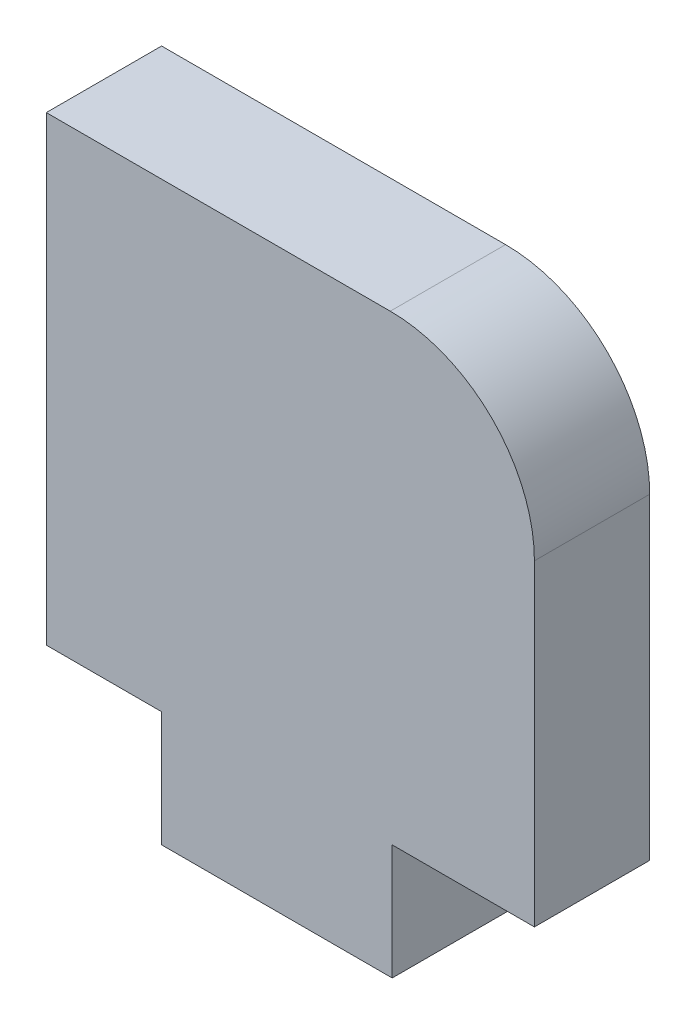
ISO-10303-21;
HEADER;
FILE_DESCRIPTION(('STEP AP214'),'2;1');
FILE_NAME('part.step','',(''),(''),'','','');
FILE_SCHEMA(('AUTOMOTIVE_DESIGN { 1 0 10303 214 1 1 1 1 }'));
ENDSEC;
DATA;
#1=APPLICATION_CONTEXT('core data for automotive mechanical design processes');
#2=APPLICATION_PROTOCOL_DEFINITION('international standard','automotive_design',2000,#1);
#3=PRODUCT_CONTEXT('',#1,'mechanical');
#4=PRODUCT('Part','Part','',(#3));
#5=PRODUCT_RELATED_PRODUCT_CATEGORY('part','',(#4));
#6=PRODUCT_DEFINITION_FORMATION('','',#4);
#7=PRODUCT_DEFINITION_CONTEXT('part definition',#1,'design');
#8=PRODUCT_DEFINITION('design','',#6,#7);
#9=PRODUCT_DEFINITION_SHAPE('','',#8);
#10=(LENGTH_UNIT() NAMED_UNIT(*) SI_UNIT(.MILLI.,.METRE.));
#11=(NAMED_UNIT(*) PLANE_ANGLE_UNIT() SI_UNIT($,.RADIAN.));
#12=(NAMED_UNIT(*) SI_UNIT($,.STERADIAN.) SOLID_ANGLE_UNIT());
#13=UNCERTAINTY_MEASURE_WITH_UNIT(LENGTH_MEASURE(1.E-05),#10,'distance_accuracy_value','');
#14=(GEOMETRIC_REPRESENTATION_CONTEXT(3) GLOBAL_UNCERTAINTY_ASSIGNED_CONTEXT((#13)) GLOBAL_UNIT_ASSIGNED_CONTEXT((#10,
#11,#12)) REPRESENTATION_CONTEXT('',''));
#15=CARTESIAN_POINT('',(0.,0.,0.));
#16=DIRECTION('',(0.,0.,1.));
#17=DIRECTION('',(1.,0.,0.));
#18=AXIS2_PLACEMENT_3D('',#15,#16,#17);
#19=CARTESIAN_POINT('',(-5.924316659739,-11.,4.));
#20=DIRECTION('',(1.,0.,0.));
#21=DIRECTION('',(0.,0.,-1.));
#22=AXIS2_PLACEMENT_3D('',#19,#20,#21);
#23=PLANE('',#22);
#24=DIRECTION('',(0.,-1.,0.));
#25=VECTOR('',#24,1.);
#26=CARTESIAN_POINT('',(-5.924316659739,-11.,0.));
#27=LINE('',#26,#25);
#28=CARTESIAN_POINT('',(-5.924316659739,5.,0.));
#29=VERTEX_POINT('',#28);
#30=CARTESIAN_POINT('',(-5.924316659739,-11.,0.));
#31=VERTEX_POINT('',#30);
#32=EDGE_CURVE('E135',#29,#31,#27,.T.);
#33=ORIENTED_EDGE('',*,*,#32,.T.);
#34=DIRECTION('',(0.,0.,-1.));
#35=VECTOR('',#34,1.);
#36=CARTESIAN_POINT('',(-5.924316659739,-11.,4.));
#37=LINE('',#36,#35);
#38=CARTESIAN_POINT('',(-5.924316659739,-11.,4.));
#39=VERTEX_POINT('',#38);
#40=EDGE_CURVE('E11',#39,#31,#37,.T.);
#41=ORIENTED_EDGE('',*,*,#40,.F.);
#42=DIRECTION('',(0.,-1.,0.));
#43=VECTOR('',#42,1.);
#44=CARTESIAN_POINT('',(-5.924316659739,-11.,4.));
#45=LINE('',#44,#43);
#46=CARTESIAN_POINT('',(-5.924316659739,5.,4.));
#47=VERTEX_POINT('',#46);
#48=EDGE_CURVE('E151',#47,#39,#45,.T.);
#49=ORIENTED_EDGE('',*,*,#48,.F.);
#50=DIRECTION('',(0.,0.,-1.));
#51=VECTOR('',#50,1.);
#52=CARTESIAN_POINT('',(-5.924316659739,5.,4.));
#53=LINE('',#52,#51);
#54=EDGE_CURVE('E131',#47,#29,#53,.T.);
#55=ORIENTED_EDGE('',*,*,#54,.T.);
#56=EDGE_LOOP('',(#33,#41,#49,#55));
#57=FACE_BOUND('',#56,.T.);
#58=ADVANCED_FACE('F33',(#57),#23,.F.);
#59=CARTESIAN_POINT('',(-1.924316659739,-11.,4.));
#60=DIRECTION('',(0.,1.,0.));
#61=DIRECTION('',(0.,0.,1.));
#62=AXIS2_PLACEMENT_3D('',#59,#60,#61);
#63=PLANE('',#62);
#64=DIRECTION('',(1.,0.,0.));
#65=VECTOR('',#64,1.);
#66=CARTESIAN_POINT('',(-1.924316659739,-11.,0.));
#67=LINE('',#66,#65);
#68=CARTESIAN_POINT('',(-1.924316659739,-11.,0.));
#69=VERTEX_POINT('',#68);
#70=EDGE_CURVE('E138',#31,#69,#67,.T.);
#71=ORIENTED_EDGE('',*,*,#70,.T.);
#72=DIRECTION('',(0.,0.,-1.));
#73=VECTOR('',#72,1.);
#74=CARTESIAN_POINT('',(-1.924316659739,-11.,4.));
#75=LINE('',#74,#73);
#76=CARTESIAN_POINT('',(-1.924316659739,-11.,4.));
#77=VERTEX_POINT('',#76);
#78=EDGE_CURVE('E41',#77,#69,#75,.T.);
#79=ORIENTED_EDGE('',*,*,#78,.F.);
#80=DIRECTION('',(1.,0.,0.));
#81=VECTOR('',#80,1.);
#82=CARTESIAN_POINT('',(-1.924316659739,-11.,4.));
#83=LINE('',#82,#81);
#84=EDGE_CURVE('E95',#39,#77,#83,.T.);
#85=ORIENTED_EDGE('',*,*,#84,.F.);
#86=ORIENTED_EDGE('',*,*,#40,.T.);
#87=EDGE_LOOP('',(#71,#79,#85,#86));
#88=FACE_BOUND('',#87,.T.);
#89=ADVANCED_FACE('F194',(#88),#63,.F.);
#90=CARTESIAN_POINT('',(-1.924316659739,-15.,4.));
#91=DIRECTION('',(1.,0.,0.));
#92=DIRECTION('',(0.,0.,-1.));
#93=AXIS2_PLACEMENT_3D('',#90,#91,#92);
#94=PLANE('',#93);
#95=DIRECTION('',(0.,-1.,0.));
#96=VECTOR('',#95,1.);
#97=CARTESIAN_POINT('',(-1.924316659739,-15.,0.));
#98=LINE('',#97,#96);
#99=CARTESIAN_POINT('',(-1.924316659739,-15.,0.));
#100=VERTEX_POINT('',#99);
#101=EDGE_CURVE('E140',#69,#100,#98,.T.);
#102=ORIENTED_EDGE('',*,*,#101,.T.);
#103=DIRECTION('',(0.,0.,-1.));
#104=VECTOR('',#103,1.);
#105=CARTESIAN_POINT('',(-1.924316659739,-15.,4.));
#106=LINE('',#105,#104);
#107=CARTESIAN_POINT('',(-1.924316659739,-15.,4.));
#108=VERTEX_POINT('',#107);
#109=EDGE_CURVE('E161',#108,#100,#106,.T.);
#110=ORIENTED_EDGE('',*,*,#109,.F.);
#111=DIRECTION('',(0.,-1.,0.));
#112=VECTOR('',#111,1.);
#113=CARTESIAN_POINT('',(-1.924316659739,-15.,4.));
#114=LINE('',#113,#112);
#115=EDGE_CURVE('E169',#77,#108,#114,.T.);
#116=ORIENTED_EDGE('',*,*,#115,.F.);
#117=ORIENTED_EDGE('',*,*,#78,.T.);
#118=EDGE_LOOP('',(#102,#110,#116,#117));
#119=FACE_BOUND('',#118,.T.);
#120=ADVANCED_FACE('F167',(#119),#94,.F.);
#121=CARTESIAN_POINT('',(6.075683340261,-15.,4.));
#122=DIRECTION('',(0.,1.,0.));
#123=DIRECTION('',(0.,0.,1.));
#124=AXIS2_PLACEMENT_3D('',#121,#122,#123);
#125=PLANE('',#124);
#126=DIRECTION('',(1.,0.,0.));
#127=VECTOR('',#126,1.);
#128=CARTESIAN_POINT('',(6.075683340261,-15.,0.));
#129=LINE('',#128,#127);
#130=CARTESIAN_POINT('',(6.075683340261,-15.,0.));
#131=VERTEX_POINT('',#130);
#132=EDGE_CURVE('E142',#100,#131,#129,.T.);
#133=ORIENTED_EDGE('',*,*,#132,.T.);
#134=DIRECTION('',(0.,0.,-1.));
#135=VECTOR('',#134,1.);
#136=CARTESIAN_POINT('',(6.075683340261,-15.,4.));
#137=LINE('',#136,#135);
#138=CARTESIAN_POINT('',(6.075683340261,-15.,4.));
#139=VERTEX_POINT('',#138);
#140=EDGE_CURVE('E158',#139,#131,#137,.T.);
#141=ORIENTED_EDGE('',*,*,#140,.F.);
#142=DIRECTION('',(1.,0.,0.));
#143=VECTOR('',#142,1.);
#144=CARTESIAN_POINT('',(6.075683340261,-15.,4.));
#145=LINE('',#144,#143);
#146=EDGE_CURVE('E185',#108,#139,#145,.T.);
#147=ORIENTED_EDGE('',*,*,#146,.F.);
#148=ORIENTED_EDGE('',*,*,#109,.T.);
#149=EDGE_LOOP('',(#133,#141,#147,#148));
#150=FACE_BOUND('',#149,.T.);
#151=ADVANCED_FACE('F178',(#150),#125,.F.);
#152=CARTESIAN_POINT('',(6.075683340261,-11.,4.));
#153=DIRECTION('',(-1.,0.,0.));
#154=DIRECTION('',(0.,0.,1.));
#155=AXIS2_PLACEMENT_3D('',#152,#153,#154);
#156=PLANE('',#155);
#157=DIRECTION('',(0.,1.,0.));
#158=VECTOR('',#157,1.);
#159=CARTESIAN_POINT('',(6.075683340261,-11.,0.));
#160=LINE('',#159,#158);
#161=CARTESIAN_POINT('',(6.075683340261,-11.,0.));
#162=VERTEX_POINT('',#161);
#163=EDGE_CURVE('E144',#131,#162,#160,.T.);
#164=ORIENTED_EDGE('',*,*,#163,.T.);
#165=DIRECTION('',(0.,0.,-1.));
#166=VECTOR('',#165,1.);
#167=CARTESIAN_POINT('',(6.075683340261,-11.,4.));
#168=LINE('',#167,#166);
#169=CARTESIAN_POINT('',(6.075683340261,-11.,4.));
#170=VERTEX_POINT('',#169);
#171=EDGE_CURVE('E155',#170,#162,#168,.T.);
#172=ORIENTED_EDGE('',*,*,#171,.F.);
#173=DIRECTION('',(0.,1.,0.));
#174=VECTOR('',#173,1.);
#175=CARTESIAN_POINT('',(6.075683340261,-11.,4.));
#176=LINE('',#175,#174);
#177=EDGE_CURVE('E184',#139,#170,#176,.T.);
#178=ORIENTED_EDGE('',*,*,#177,.F.);
#179=ORIENTED_EDGE('',*,*,#140,.T.);
#180=EDGE_LOOP('',(#164,#172,#178,#179));
#181=FACE_BOUND('',#180,.T.);
#182=ADVANCED_FACE('F182',(#181),#156,.F.);
#183=CARTESIAN_POINT('',(6.075683340261,-11.,4.));
#184=DIRECTION('',(0.,1.,0.));
#185=DIRECTION('',(0.,0.,1.));
#186=AXIS2_PLACEMENT_3D('',#183,#184,#185);
#187=PLANE('',#186);
#188=DIRECTION('',(1.,0.,0.));
#189=VECTOR('',#188,1.);
#190=CARTESIAN_POINT('',(6.075683340261,-11.,0.));
#191=LINE('',#190,#189);
#192=CARTESIAN_POINT('',(11.0088575449908,-11.,0.));
#193=VERTEX_POINT('',#192);
#194=EDGE_CURVE('E146',#162,#193,#191,.T.);
#195=ORIENTED_EDGE('',*,*,#194,.T.);
#196=DIRECTION('',(0.,0.,-1.));
#197=VECTOR('',#196,1.);
#198=CARTESIAN_POINT('',(11.0088575449908,-11.,4.));
#199=LINE('',#198,#197);
#200=CARTESIAN_POINT('',(11.0088575449908,-11.,4.));
#201=VERTEX_POINT('',#200);
#202=EDGE_CURVE('E126',#201,#193,#199,.T.);
#203=ORIENTED_EDGE('',*,*,#202,.F.);
#204=DIRECTION('',(1.,0.,0.));
#205=VECTOR('',#204,1.);
#206=CARTESIAN_POINT('',(6.075683340261,-11.,4.));
#207=LINE('',#206,#205);
#208=EDGE_CURVE('E117',#170,#201,#207,.T.);
#209=ORIENTED_EDGE('',*,*,#208,.F.);
#210=ORIENTED_EDGE('',*,*,#171,.T.);
#211=EDGE_LOOP('',(#195,#203,#209,#210));
#212=FACE_BOUND('',#211,.T.);
#213=ADVANCED_FACE('F206',(#212),#187,.F.);
#214=CARTESIAN_POINT('',(11.0088575449908,0.,4.));
#215=DIRECTION('',(-1.,0.,0.));
#216=DIRECTION('',(0.,-1.,0.));
#217=AXIS2_PLACEMENT_3D('',#214,#215,#216);
#218=PLANE('',#217);
#219=DIRECTION('',(0.,1.,0.));
#220=VECTOR('',#219,1.);
#221=CARTESIAN_POINT('',(11.0088575449908,0.,0.));
#222=LINE('',#221,#220);
#223=CARTESIAN_POINT('',(11.0088575449908,0.,0.));
#224=VERTEX_POINT('',#223);
#225=EDGE_CURVE('E125',#193,#224,#222,.T.);
#226=ORIENTED_EDGE('',*,*,#225,.T.);
#227=DIRECTION('',(0.,0.,-1.));
#228=VECTOR('',#227,1.);
#229=CARTESIAN_POINT('',(11.0088575449908,0.,4.));
#230=LINE('',#229,#228);
#231=CARTESIAN_POINT('',(11.0088575449908,0.,4.));
#232=VERTEX_POINT('',#231);
#233=EDGE_CURVE('E122',#232,#224,#230,.T.);
#234=ORIENTED_EDGE('',*,*,#233,.F.);
#235=DIRECTION('',(0.,1.,0.));
#236=VECTOR('',#235,1.);
#237=CARTESIAN_POINT('',(11.0088575449908,0.,4.));
#238=LINE('',#237,#236);
#239=EDGE_CURVE('E111',#201,#232,#238,.T.);
#240=ORIENTED_EDGE('',*,*,#239,.F.);
#241=ORIENTED_EDGE('',*,*,#202,.T.);
#242=EDGE_LOOP('',(#226,#234,#240,#241));
#243=FACE_BOUND('',#242,.T.);
#244=ADVANCED_FACE('F123',(#243),#218,.F.);
#245=CARTESIAN_POINT('',(6.00885754499076,0.,4.));
#246=DIRECTION('',(0.,0.,-1.));
#247=DIRECTION('',(-1.,0.,0.));
#248=AXIS2_PLACEMENT_3D('',#245,#246,#247);
#249=CYLINDRICAL_SURFACE('',#248,5.);
#250=CARTESIAN_POINT('',(6.00885754499076,0.,0.));
#251=DIRECTION('',(0.,0.,1.));
#252=DIRECTION('',(1.,0.,0.));
#253=AXIS2_PLACEMENT_3D('',#250,#251,#252);
#254=CIRCLE('',#253,5.);
#255=CARTESIAN_POINT('',(6.00885754499076,5.,0.));
#256=VERTEX_POINT('',#255);
#257=EDGE_CURVE('E81',#224,#256,#254,.T.);
#258=ORIENTED_EDGE('',*,*,#257,.T.);
#259=DIRECTION('',(0.,0.,-1.));
#260=VECTOR('',#259,1.);
#261=CARTESIAN_POINT('',(6.00885754499076,5.,4.));
#262=LINE('',#261,#260);
#263=CARTESIAN_POINT('',(6.00885754499076,5.,4.));
#264=VERTEX_POINT('',#263);
#265=EDGE_CURVE('E127',#264,#256,#262,.T.);
#266=ORIENTED_EDGE('',*,*,#265,.F.);
#267=CARTESIAN_POINT('',(6.00885754499076,0.,4.));
#268=DIRECTION('',(0.,0.,1.));
#269=DIRECTION('',(1.,0.,0.));
#270=AXIS2_PLACEMENT_3D('',#267,#268,#269);
#271=CIRCLE('',#270,5.);
#272=EDGE_CURVE('E115',#232,#264,#271,.T.);
#273=ORIENTED_EDGE('',*,*,#272,.F.);
#274=ORIENTED_EDGE('',*,*,#233,.T.);
#275=EDGE_LOOP('',(#258,#266,#273,#274));
#276=FACE_BOUND('',#275,.T.);
#277=ADVANCED_FACE('F129',(#276),#249,.T.);
#278=CARTESIAN_POINT('',(-5.924316659739,5.,4.));
#279=DIRECTION('',(0.,-1.,0.));
#280=DIRECTION('',(1.,0.,0.));
#281=AXIS2_PLACEMENT_3D('',#278,#279,#280);
#282=PLANE('',#281);
#283=DIRECTION('',(-1.,0.,0.));
#284=VECTOR('',#283,1.);
#285=CARTESIAN_POINT('',(-5.924316659739,5.,0.));
#286=LINE('',#285,#284);
#287=EDGE_CURVE('E87',#256,#29,#286,.T.);
#288=ORIENTED_EDGE('',*,*,#287,.T.);
#289=ORIENTED_EDGE('',*,*,#54,.F.);
#290=DIRECTION('',(-1.,0.,0.));
#291=VECTOR('',#290,1.);
#292=CARTESIAN_POINT('',(-5.924316659739,5.,4.));
#293=LINE('',#292,#291);
#294=EDGE_CURVE('E49',#264,#47,#293,.T.);
#295=ORIENTED_EDGE('',*,*,#294,.F.);
#296=ORIENTED_EDGE('',*,*,#265,.T.);
#297=EDGE_LOOP('',(#288,#289,#295,#296));
#298=FACE_BOUND('',#297,.T.);
#299=ADVANCED_FACE('F214',(#298),#282,.F.);
#300=CARTESIAN_POINT('',(6.00885754499076,0.,4.));
#301=DIRECTION('',(0.,0.,1.));
#302=DIRECTION('',(1.,0.,0.));
#303=AXIS2_PLACEMENT_3D('',#300,#301,#302);
#304=PLANE('',#303);
#305=ORIENTED_EDGE('',*,*,#48,.T.);
#306=ORIENTED_EDGE('',*,*,#84,.T.);
#307=ORIENTED_EDGE('',*,*,#115,.T.);
#308=ORIENTED_EDGE('',*,*,#146,.T.);
#309=ORIENTED_EDGE('',*,*,#177,.T.);
#310=ORIENTED_EDGE('',*,*,#208,.T.);
#311=ORIENTED_EDGE('',*,*,#239,.T.);
#312=ORIENTED_EDGE('',*,*,#272,.T.);
#313=ORIENTED_EDGE('',*,*,#294,.T.);
#314=EDGE_LOOP('',(#305,#306,#307,#308,#309,#310,#311,#312,#313));
#315=FACE_BOUND('',#314,.T.);
#316=ADVANCED_FACE('F113',(#315),#304,.T.);
#317=CARTESIAN_POINT('',(6.00885754499076,0.,0.));
#318=DIRECTION('',(0.,0.,1.));
#319=DIRECTION('',(1.,0.,0.));
#320=AXIS2_PLACEMENT_3D('',#317,#318,#319);
#321=PLANE('',#320);
#322=ORIENTED_EDGE('',*,*,#32,.F.);
#323=ORIENTED_EDGE('',*,*,#287,.F.);
#324=ORIENTED_EDGE('',*,*,#257,.F.);
#325=ORIENTED_EDGE('',*,*,#225,.F.);
#326=ORIENTED_EDGE('',*,*,#194,.F.);
#327=ORIENTED_EDGE('',*,*,#163,.F.);
#328=ORIENTED_EDGE('',*,*,#132,.F.);
#329=ORIENTED_EDGE('',*,*,#101,.F.);
#330=ORIENTED_EDGE('',*,*,#70,.F.);
#331=EDGE_LOOP('',(#322,#323,#324,#325,#326,#327,#328,#329,#330));
#332=FACE_BOUND('',#331,.T.);
#333=ADVANCED_FACE('F173',(#332),#321,.F.);
#334=CLOSED_SHELL('',(#58,#89,#120,#151,#182,#213,#244,#277,#299,#316,#333));
#335=MANIFOLD_SOLID_BREP('B2',#334);
#336=ADVANCED_BREP_SHAPE_REPRESENTATION('',(#18,#335),#14);
#337=SHAPE_DEFINITION_REPRESENTATION(#9,#336);
ENDSEC;
END-ISO-10303-21;
